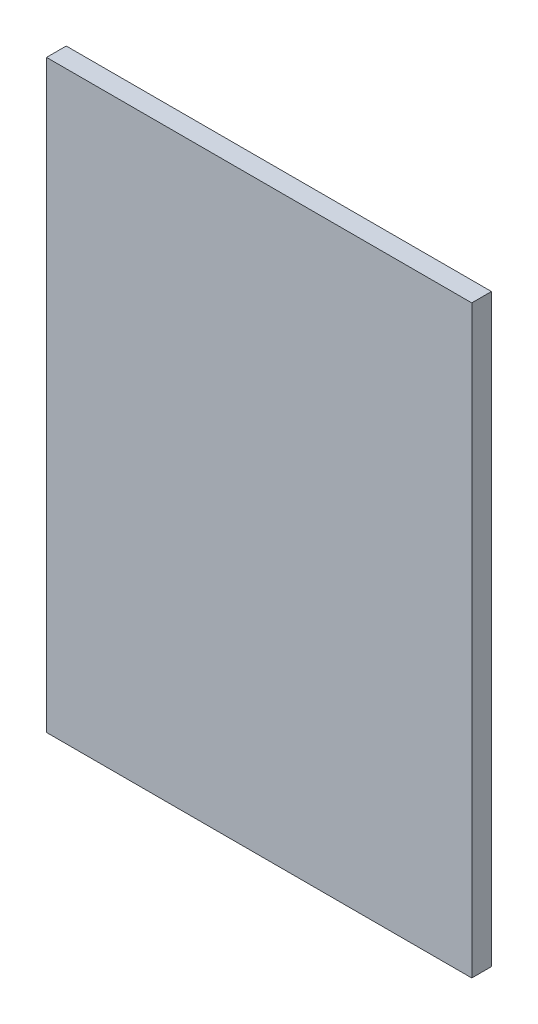
ISO-10303-21;
HEADER;
FILE_DESCRIPTION(('STEP AP214'),'2;1');
FILE_NAME('part.step','',(''),(''),'','','');
FILE_SCHEMA(('AUTOMOTIVE_DESIGN { 1 0 10303 214 1 1 1 1 }'));
ENDSEC;
DATA;
#1=APPLICATION_CONTEXT('core data for automotive mechanical design processes');
#2=APPLICATION_PROTOCOL_DEFINITION('international standard','automotive_design',2000,#1);
#3=PRODUCT_CONTEXT('',#1,'mechanical');
#4=PRODUCT('Part','Part','',(#3));
#5=PRODUCT_RELATED_PRODUCT_CATEGORY('part','',(#4));
#6=PRODUCT_DEFINITION_FORMATION('','',#4);
#7=PRODUCT_DEFINITION_CONTEXT('part definition',#1,'design');
#8=PRODUCT_DEFINITION('design','',#6,#7);
#9=PRODUCT_DEFINITION_SHAPE('','',#8);
#10=(LENGTH_UNIT() NAMED_UNIT(*) SI_UNIT(.MILLI.,.METRE.));
#11=(NAMED_UNIT(*) PLANE_ANGLE_UNIT() SI_UNIT($,.RADIAN.));
#12=(NAMED_UNIT(*) SI_UNIT($,.STERADIAN.) SOLID_ANGLE_UNIT());
#13=UNCERTAINTY_MEASURE_WITH_UNIT(LENGTH_MEASURE(1.E-05),#10,'distance_accuracy_value','');
#14=(GEOMETRIC_REPRESENTATION_CONTEXT(3) GLOBAL_UNCERTAINTY_ASSIGNED_CONTEXT((#13)) GLOBAL_UNIT_ASSIGNED_CONTEXT((#10,
#11,#12)) REPRESENTATION_CONTEXT('',''));
#15=CARTESIAN_POINT('',(0.,0.,0.));
#16=DIRECTION('',(0.,0.,1.));
#17=DIRECTION('',(1.,0.,0.));
#18=AXIS2_PLACEMENT_3D('',#15,#16,#17);
#19=CARTESIAN_POINT('',(0.,0.,0.));
#20=DIRECTION('',(0.,0.,1.));
#21=DIRECTION('',(1.,0.,0.));
#22=AXIS2_PLACEMENT_3D('',#19,#20,#21);
#23=PLANE('',#22);
#24=DIRECTION('',(-1.,0.,0.));
#25=VECTOR('',#24,1.);
#26=CARTESIAN_POINT('',(10.39999961853,0.,0.));
#27=LINE('',#26,#25);
#28=CARTESIAN_POINT('',(10.39999961853,0.,0.));
#29=VERTEX_POINT('',#28);
#30=CARTESIAN_POINT('',(0.,0.,0.));
#31=VERTEX_POINT('',#30);
#32=EDGE_CURVE('E26',#29,#31,#27,.T.);
#33=ORIENTED_EDGE('',*,*,#32,.F.);
#34=DIRECTION('',(0.,-1.,0.));
#35=VECTOR('',#34,1.);
#36=CARTESIAN_POINT('',(10.39999961853,14.300000190735,0.));
#37=LINE('',#36,#35);
#38=CARTESIAN_POINT('',(10.39999961853,14.300000190735,0.));
#39=VERTEX_POINT('',#38);
#40=EDGE_CURVE('E66',#39,#29,#37,.T.);
#41=ORIENTED_EDGE('',*,*,#40,.F.);
#42=DIRECTION('',(1.,0.,0.));
#43=VECTOR('',#42,1.);
#44=CARTESIAN_POINT('',(0.,14.300000190735,0.));
#45=LINE('',#44,#43);
#46=CARTESIAN_POINT('',(0.,14.300000190735,0.));
#47=VERTEX_POINT('',#46);
#48=EDGE_CURVE('E69',#47,#39,#45,.T.);
#49=ORIENTED_EDGE('',*,*,#48,.F.);
#50=DIRECTION('',(0.,1.,0.));
#51=VECTOR('',#50,1.);
#52=CARTESIAN_POINT('',(0.,0.,0.));
#53=LINE('',#52,#51);
#54=EDGE_CURVE('E170',#31,#47,#53,.T.);
#55=ORIENTED_EDGE('',*,*,#54,.F.);
#56=EDGE_LOOP('',(#33,#41,#49,#55));
#57=FACE_BOUND('',#56,.T.);
#58=ADVANCED_FACE('F17',(#57),#23,.T.);
#59=CARTESIAN_POINT('',(0.,0.,-0.48199802));
#60=DIRECTION('',(0.,0.,1.));
#61=DIRECTION('',(1.,0.,0.));
#62=AXIS2_PLACEMENT_3D('',#59,#60,#61);
#63=PLANE('',#62);
#64=DIRECTION('',(0.,1.,0.));
#65=VECTOR('',#64,1.);
#66=CARTESIAN_POINT('',(0.,0.,-0.48199802));
#67=LINE('',#66,#65);
#68=CARTESIAN_POINT('',(0.,0.,-0.48199802));
#69=VERTEX_POINT('',#68);
#70=CARTESIAN_POINT('',(0.,14.300000190735,-0.48199802));
#71=VERTEX_POINT('',#70);
#72=EDGE_CURVE('E90',#69,#71,#67,.T.);
#73=ORIENTED_EDGE('',*,*,#72,.T.);
#74=DIRECTION('',(1.,0.,0.));
#75=VECTOR('',#74,1.);
#76=CARTESIAN_POINT('',(0.,14.300000190735,-0.48199802));
#77=LINE('',#76,#75);
#78=CARTESIAN_POINT('',(10.39999961853,14.300000190735,-0.48199802));
#79=VERTEX_POINT('',#78);
#80=EDGE_CURVE('E75',#71,#79,#77,.T.);
#81=ORIENTED_EDGE('',*,*,#80,.T.);
#82=DIRECTION('',(0.,-1.,0.));
#83=VECTOR('',#82,1.);
#84=CARTESIAN_POINT('',(10.39999961853,14.300000190735,-0.48199802));
#85=LINE('',#84,#83);
#86=CARTESIAN_POINT('',(10.39999961853,0.,-0.48199802));
#87=VERTEX_POINT('',#86);
#88=EDGE_CURVE('E80',#79,#87,#85,.T.);
#89=ORIENTED_EDGE('',*,*,#88,.T.);
#90=DIRECTION('',(-1.,0.,0.));
#91=VECTOR('',#90,1.);
#92=CARTESIAN_POINT('',(10.39999961853,0.,-0.48199802));
#93=LINE('',#92,#91);
#94=EDGE_CURVE('E11',#87,#69,#93,.T.);
#95=ORIENTED_EDGE('',*,*,#94,.T.);
#96=EDGE_LOOP('',(#73,#81,#89,#95));
#97=FACE_BOUND('',#96,.T.);
#98=ADVANCED_FACE('F19',(#97),#63,.F.);
#99=CARTESIAN_POINT('',(10.39999961853,0.,-0.48199802));
#100=DIRECTION('',(0.,-1.,0.));
#101=DIRECTION('',(0.,0.,-1.));
#102=AXIS2_PLACEMENT_3D('',#99,#100,#101);
#103=PLANE('',#102);
#104=DIRECTION('',(0.,0.,1.));
#105=VECTOR('',#104,1.);
#106=CARTESIAN_POINT('',(10.39999961853,0.,-0.48199802));
#107=LINE('',#106,#105);
#108=EDGE_CURVE('E74',#87,#29,#107,.T.);
#109=ORIENTED_EDGE('',*,*,#108,.T.);
#110=ORIENTED_EDGE('',*,*,#32,.T.);
#111=DIRECTION('',(0.,0.,1.));
#112=VECTOR('',#111,1.);
#113=CARTESIAN_POINT('',(0.,0.,-0.48199802));
#114=LINE('',#113,#112);
#115=EDGE_CURVE('E169',#69,#31,#114,.T.);
#116=ORIENTED_EDGE('',*,*,#115,.F.);
#117=ORIENTED_EDGE('',*,*,#94,.F.);
#118=EDGE_LOOP('',(#109,#110,#116,#117));
#119=FACE_BOUND('',#118,.T.);
#120=ADVANCED_FACE('F107',(#119),#103,.T.);
#121=CARTESIAN_POINT('',(10.39999961853,14.300000190735,-0.48199802));
#122=DIRECTION('',(1.,0.,0.));
#123=DIRECTION('',(0.,1.,0.));
#124=AXIS2_PLACEMENT_3D('',#121,#122,#123);
#125=PLANE('',#124);
#126=DIRECTION('',(0.,0.,1.));
#127=VECTOR('',#126,1.);
#128=CARTESIAN_POINT('',(10.39999961853,14.300000190735,-0.48199802));
#129=LINE('',#128,#127);
#130=EDGE_CURVE('E78',#79,#39,#129,.T.);
#131=ORIENTED_EDGE('',*,*,#130,.T.);
#132=ORIENTED_EDGE('',*,*,#40,.T.);
#133=ORIENTED_EDGE('',*,*,#108,.F.);
#134=ORIENTED_EDGE('',*,*,#88,.F.);
#135=EDGE_LOOP('',(#131,#132,#133,#134));
#136=FACE_BOUND('',#135,.T.);
#137=ADVANCED_FACE('F79',(#136),#125,.T.);
#138=CARTESIAN_POINT('',(0.,14.300000190735,-0.48199802));
#139=DIRECTION('',(0.,1.,0.));
#140=DIRECTION('',(1.,0.,0.));
#141=AXIS2_PLACEMENT_3D('',#138,#139,#140);
#142=PLANE('',#141);
#143=DIRECTION('',(0.,0.,1.));
#144=VECTOR('',#143,1.);
#145=CARTESIAN_POINT('',(0.,14.300000190735,-0.48199802));
#146=LINE('',#145,#144);
#147=EDGE_CURVE('E87',#71,#47,#146,.T.);
#148=ORIENTED_EDGE('',*,*,#147,.T.);
#149=ORIENTED_EDGE('',*,*,#48,.T.);
#150=ORIENTED_EDGE('',*,*,#130,.F.);
#151=ORIENTED_EDGE('',*,*,#80,.F.);
#152=EDGE_LOOP('',(#148,#149,#150,#151));
#153=FACE_BOUND('',#152,.T.);
#154=ADVANCED_FACE('F85',(#153),#142,.T.);
#155=CARTESIAN_POINT('',(0.,0.,-0.48199802));
#156=DIRECTION('',(-1.,0.,0.));
#157=DIRECTION('',(0.,0.,1.));
#158=AXIS2_PLACEMENT_3D('',#155,#156,#157);
#159=PLANE('',#158);
#160=ORIENTED_EDGE('',*,*,#115,.T.);
#161=ORIENTED_EDGE('',*,*,#54,.T.);
#162=ORIENTED_EDGE('',*,*,#147,.F.);
#163=ORIENTED_EDGE('',*,*,#72,.F.);
#164=EDGE_LOOP('',(#160,#161,#162,#163));
#165=FACE_BOUND('',#164,.T.);
#166=ADVANCED_FACE('F122',(#165),#159,.T.);
#167=CLOSED_SHELL('',(#58,#98,#120,#137,#154,#166));
#168=MANIFOLD_SOLID_BREP('B1',#167);
#169=ADVANCED_BREP_SHAPE_REPRESENTATION('',(#18,#168),#14);
#170=SHAPE_DEFINITION_REPRESENTATION(#9,#169);
ENDSEC;
END-ISO-10303-21;
